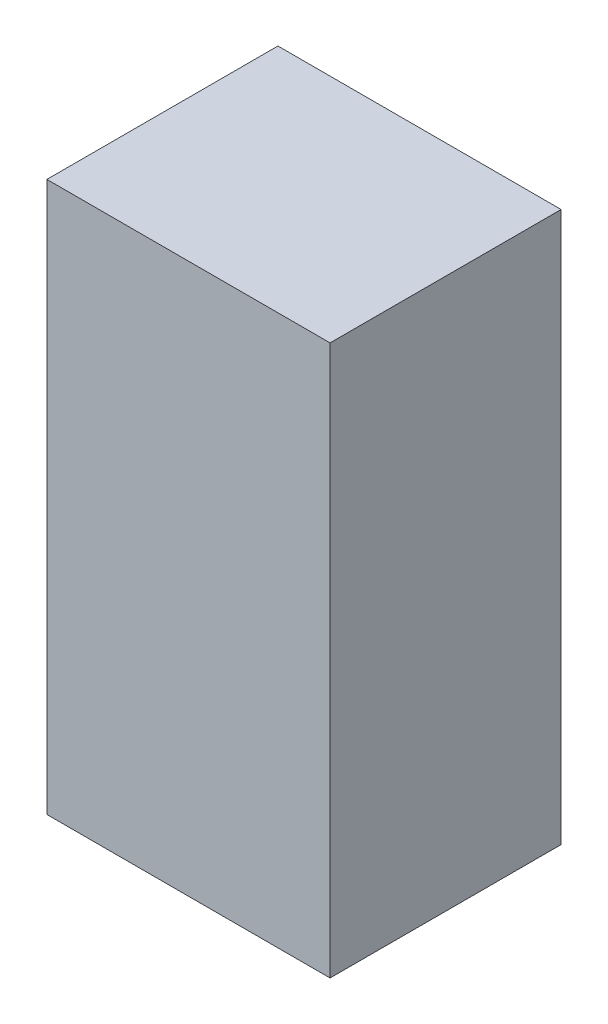
ISO-10303-21;
HEADER;
FILE_DESCRIPTION(('STEP AP214'),'2;1');
FILE_NAME('part.step','',(''),(''),'','','');
FILE_SCHEMA(('AUTOMOTIVE_DESIGN { 1 0 10303 214 1 1 1 1 }'));
ENDSEC;
DATA;
#1=APPLICATION_CONTEXT('core data for automotive mechanical design processes');
#2=APPLICATION_PROTOCOL_DEFINITION('international standard','automotive_design',2000,#1);
#3=PRODUCT_CONTEXT('',#1,'mechanical');
#4=PRODUCT('Part','Part','',(#3));
#5=PRODUCT_RELATED_PRODUCT_CATEGORY('part','',(#4));
#6=PRODUCT_DEFINITION_FORMATION('','',#4);
#7=PRODUCT_DEFINITION_CONTEXT('part definition',#1,'design');
#8=PRODUCT_DEFINITION('design','',#6,#7);
#9=PRODUCT_DEFINITION_SHAPE('','',#8);
#10=(LENGTH_UNIT() NAMED_UNIT(*) SI_UNIT(.MILLI.,.METRE.));
#11=(NAMED_UNIT(*) PLANE_ANGLE_UNIT() SI_UNIT($,.RADIAN.));
#12=(NAMED_UNIT(*) SI_UNIT($,.STERADIAN.) SOLID_ANGLE_UNIT());
#13=UNCERTAINTY_MEASURE_WITH_UNIT(LENGTH_MEASURE(1.E-05),#10,'distance_accuracy_value','');
#14=(GEOMETRIC_REPRESENTATION_CONTEXT(3) GLOBAL_UNCERTAINTY_ASSIGNED_CONTEXT((#13)) GLOBAL_UNIT_ASSIGNED_CONTEXT((#10,
#11,#12)) REPRESENTATION_CONTEXT('',''));
#15=CARTESIAN_POINT('',(0.,0.,0.));
#16=DIRECTION('',(0.,0.,1.));
#17=DIRECTION('',(1.,0.,0.));
#18=AXIS2_PLACEMENT_3D('',#15,#16,#17);
#19=CARTESIAN_POINT('',(-5.075,-9.63,13.87));
#20=DIRECTION('',(0.,0.,-1.));
#21=DIRECTION('',(0.,-1.,0.));
#22=AXIS2_PLACEMENT_3D('',#19,#20,#21);
#23=PLANE('',#22);
#24=DIRECTION('',(0.,1.,0.));
#25=VECTOR('',#24,1.);
#26=CARTESIAN_POINT('',(-13.575,-26.14,13.87));
#27=LINE('',#26,#25);
#28=CARTESIAN_POINT('',(-13.575,-26.14,13.87));
#29=VERTEX_POINT('',#28);
#30=CARTESIAN_POINT('',(-13.575,6.88,13.87));
#31=VERTEX_POINT('',#30);
#32=EDGE_CURVE('E27',#29,#31,#27,.T.);
#33=ORIENTED_EDGE('',*,*,#32,.F.);
#34=DIRECTION('',(-1.,0.,0.));
#35=VECTOR('',#34,1.);
#36=CARTESIAN_POINT('',(3.425,-26.14,13.87));
#37=LINE('',#36,#35);
#38=CARTESIAN_POINT('',(3.425,-26.14,13.87));
#39=VERTEX_POINT('',#38);
#40=EDGE_CURVE('E99',#39,#29,#37,.T.);
#41=ORIENTED_EDGE('',*,*,#40,.F.);
#42=DIRECTION('',(0.,-1.,0.));
#43=VECTOR('',#42,1.);
#44=CARTESIAN_POINT('',(3.425,6.88,13.87));
#45=LINE('',#44,#43);
#46=CARTESIAN_POINT('',(3.425,6.88,13.87));
#47=VERTEX_POINT('',#46);
#48=EDGE_CURVE('E78',#47,#39,#45,.T.);
#49=ORIENTED_EDGE('',*,*,#48,.F.);
#50=DIRECTION('',(1.,0.,0.));
#51=VECTOR('',#50,1.);
#52=CARTESIAN_POINT('',(-13.575,6.88,13.87));
#53=LINE('',#52,#51);
#54=EDGE_CURVE('E76',#31,#47,#53,.T.);
#55=ORIENTED_EDGE('',*,*,#54,.F.);
#56=EDGE_LOOP('',(#33,#41,#49,#55));
#57=FACE_BOUND('',#56,.T.);
#58=ADVANCED_FACE('F16',(#57),#23,.F.);
#59=CARTESIAN_POINT('',(-5.075,-9.63,0.));
#60=DIRECTION('',(0.,0.,-1.));
#61=DIRECTION('',(0.,-1.,0.));
#62=AXIS2_PLACEMENT_3D('',#59,#60,#61);
#63=PLANE('',#62);
#64=DIRECTION('',(1.,0.,0.));
#65=VECTOR('',#64,1.);
#66=CARTESIAN_POINT('',(-13.575,6.88,0.));
#67=LINE('',#66,#65);
#68=CARTESIAN_POINT('',(-13.575,6.88,0.));
#69=VERTEX_POINT('',#68);
#70=CARTESIAN_POINT('',(3.425,6.88,0.));
#71=VERTEX_POINT('',#70);
#72=EDGE_CURVE('E86',#69,#71,#67,.T.);
#73=ORIENTED_EDGE('',*,*,#72,.T.);
#74=DIRECTION('',(0.,-1.,0.));
#75=VECTOR('',#74,1.);
#76=CARTESIAN_POINT('',(3.425,6.88,0.));
#77=LINE('',#76,#75);
#78=CARTESIAN_POINT('',(3.425,-26.14,0.));
#79=VERTEX_POINT('',#78);
#80=EDGE_CURVE('E95',#71,#79,#77,.T.);
#81=ORIENTED_EDGE('',*,*,#80,.T.);
#82=DIRECTION('',(-1.,0.,0.));
#83=VECTOR('',#82,1.);
#84=CARTESIAN_POINT('',(3.425,-26.14,0.));
#85=LINE('',#84,#83);
#86=CARTESIAN_POINT('',(-13.575,-26.14,0.));
#87=VERTEX_POINT('',#86);
#88=EDGE_CURVE('E20',#79,#87,#85,.T.);
#89=ORIENTED_EDGE('',*,*,#88,.T.);
#90=DIRECTION('',(0.,1.,0.));
#91=VECTOR('',#90,1.);
#92=CARTESIAN_POINT('',(-13.575,-26.14,0.));
#93=LINE('',#92,#91);
#94=EDGE_CURVE('E11',#87,#69,#93,.T.);
#95=ORIENTED_EDGE('',*,*,#94,.T.);
#96=EDGE_LOOP('',(#73,#81,#89,#95));
#97=FACE_BOUND('',#96,.T.);
#98=ADVANCED_FACE('F115',(#97),#63,.T.);
#99=CARTESIAN_POINT('',(-13.575,-26.14,0.));
#100=DIRECTION('',(-1.,0.,0.));
#101=DIRECTION('',(0.,0.,1.));
#102=AXIS2_PLACEMENT_3D('',#99,#100,#101);
#103=PLANE('',#102);
#104=DIRECTION('',(0.,0.,1.));
#105=VECTOR('',#104,1.);
#106=CARTESIAN_POINT('',(-13.575,-26.14,0.));
#107=LINE('',#106,#105);
#108=EDGE_CURVE('E70',#87,#29,#107,.T.);
#109=ORIENTED_EDGE('',*,*,#108,.T.);
#110=ORIENTED_EDGE('',*,*,#32,.T.);
#111=DIRECTION('',(0.,0.,1.));
#112=VECTOR('',#111,1.);
#113=CARTESIAN_POINT('',(-13.575,6.88,0.));
#114=LINE('',#113,#112);
#115=EDGE_CURVE('E68',#69,#31,#114,.T.);
#116=ORIENTED_EDGE('',*,*,#115,.F.);
#117=ORIENTED_EDGE('',*,*,#94,.F.);
#118=EDGE_LOOP('',(#109,#110,#116,#117));
#119=FACE_BOUND('',#118,.T.);
#120=ADVANCED_FACE('F18',(#119),#103,.T.);
#121=CARTESIAN_POINT('',(3.425,-26.14,0.));
#122=DIRECTION('',(0.,-1.,0.));
#123=DIRECTION('',(0.,0.,-1.));
#124=AXIS2_PLACEMENT_3D('',#121,#122,#123);
#125=PLANE('',#124);
#126=DIRECTION('',(0.,0.,1.));
#127=VECTOR('',#126,1.);
#128=CARTESIAN_POINT('',(3.425,-26.14,0.));
#129=LINE('',#128,#127);
#130=EDGE_CURVE('E100',#79,#39,#129,.T.);
#131=ORIENTED_EDGE('',*,*,#130,.T.);
#132=ORIENTED_EDGE('',*,*,#40,.T.);
#133=ORIENTED_EDGE('',*,*,#108,.F.);
#134=ORIENTED_EDGE('',*,*,#88,.F.);
#135=EDGE_LOOP('',(#131,#132,#133,#134));
#136=FACE_BOUND('',#135,.T.);
#137=ADVANCED_FACE('F123',(#136),#125,.T.);
#138=CARTESIAN_POINT('',(3.425,6.88,0.));
#139=DIRECTION('',(1.,0.,0.));
#140=DIRECTION('',(0.,1.,0.));
#141=AXIS2_PLACEMENT_3D('',#138,#139,#140);
#142=PLANE('',#141);
#143=DIRECTION('',(0.,0.,1.));
#144=VECTOR('',#143,1.);
#145=CARTESIAN_POINT('',(3.425,6.88,0.));
#146=LINE('',#145,#144);
#147=EDGE_CURVE('E83',#71,#47,#146,.T.);
#148=ORIENTED_EDGE('',*,*,#147,.T.);
#149=ORIENTED_EDGE('',*,*,#48,.T.);
#150=ORIENTED_EDGE('',*,*,#130,.F.);
#151=ORIENTED_EDGE('',*,*,#80,.F.);
#152=EDGE_LOOP('',(#148,#149,#150,#151));
#153=FACE_BOUND('',#152,.T.);
#154=ADVANCED_FACE('F114',(#153),#142,.T.);
#155=CARTESIAN_POINT('',(-13.575,6.88,0.));
#156=DIRECTION('',(0.,1.,0.));
#157=DIRECTION('',(1.,0.,0.));
#158=AXIS2_PLACEMENT_3D('',#155,#156,#157);
#159=PLANE('',#158);
#160=ORIENTED_EDGE('',*,*,#115,.T.);
#161=ORIENTED_EDGE('',*,*,#54,.T.);
#162=ORIENTED_EDGE('',*,*,#147,.F.);
#163=ORIENTED_EDGE('',*,*,#72,.F.);
#164=EDGE_LOOP('',(#160,#161,#162,#163));
#165=FACE_BOUND('',#164,.T.);
#166=ADVANCED_FACE('F85',(#165),#159,.T.);
#167=CLOSED_SHELL('',(#58,#98,#120,#137,#154,#166));
#168=MANIFOLD_SOLID_BREP('B1',#167);
#169=ADVANCED_BREP_SHAPE_REPRESENTATION('',(#18,#168),#14);
#170=SHAPE_DEFINITION_REPRESENTATION(#9,#169);
ENDSEC;
END-ISO-10303-21;
